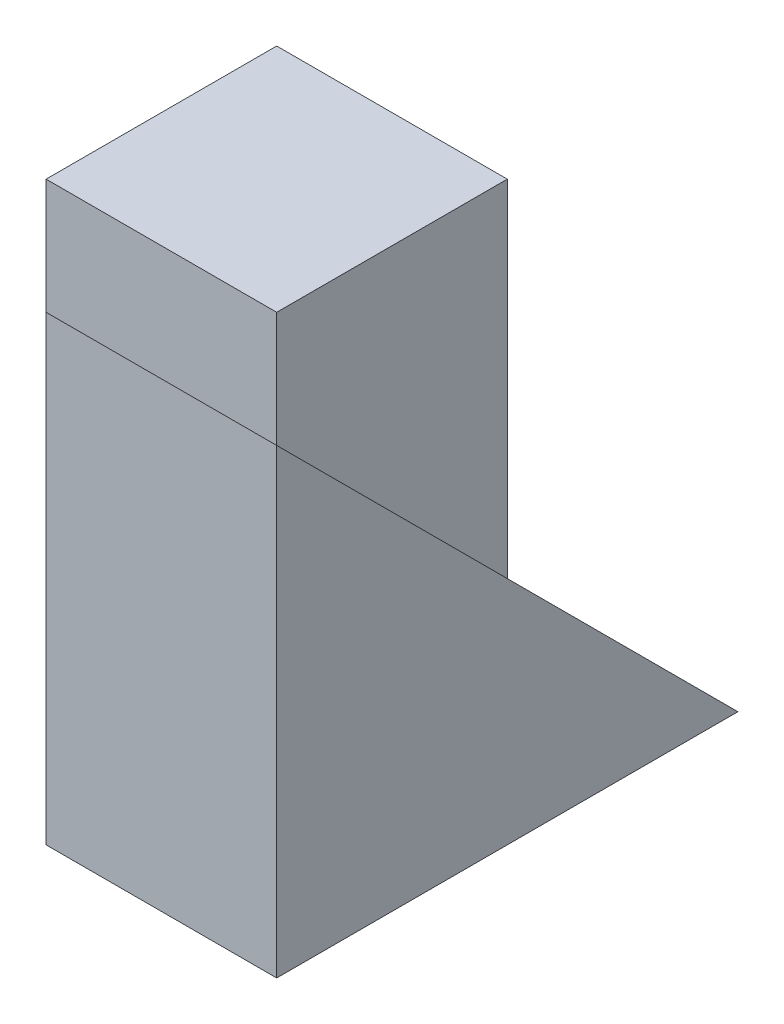
ISO-10303-21;
HEADER;
FILE_DESCRIPTION(('STEP AP214'),'2;1');
FILE_NAME('part.step','',(''),(''),'','','');
FILE_SCHEMA(('AUTOMOTIVE_DESIGN { 1 0 10303 214 1 1 1 1 }'));
ENDSEC;
DATA;
#1=APPLICATION_CONTEXT('core data for automotive mechanical design processes');
#2=APPLICATION_PROTOCOL_DEFINITION('international standard','automotive_design',2000,#1);
#3=PRODUCT_CONTEXT('',#1,'mechanical');
#4=PRODUCT('Part','Part','',(#3));
#5=PRODUCT_RELATED_PRODUCT_CATEGORY('part','',(#4));
#6=PRODUCT_DEFINITION_FORMATION('','',#4);
#7=PRODUCT_DEFINITION_CONTEXT('part definition',#1,'design');
#8=PRODUCT_DEFINITION('design','',#6,#7);
#9=PRODUCT_DEFINITION_SHAPE('','',#8);
#10=(LENGTH_UNIT() NAMED_UNIT(*) SI_UNIT(.MILLI.,.METRE.));
#11=(NAMED_UNIT(*) PLANE_ANGLE_UNIT() SI_UNIT($,.RADIAN.));
#12=(NAMED_UNIT(*) SI_UNIT($,.STERADIAN.) SOLID_ANGLE_UNIT());
#13=UNCERTAINTY_MEASURE_WITH_UNIT(LENGTH_MEASURE(1.E-05),#10,'distance_accuracy_value','');
#14=(GEOMETRIC_REPRESENTATION_CONTEXT(3) GLOBAL_UNCERTAINTY_ASSIGNED_CONTEXT((#13)) GLOBAL_UNIT_ASSIGNED_CONTEXT((#10,
#11,#12)) REPRESENTATION_CONTEXT('',''));
#15=CARTESIAN_POINT('',(0.,0.,0.));
#16=DIRECTION('',(0.,0.,1.));
#17=DIRECTION('',(1.,0.,0.));
#18=AXIS2_PLACEMENT_3D('',#15,#16,#17);
#19=CARTESIAN_POINT('',(2.,0.,0.));
#20=DIRECTION('',(0.,0.,-1.));
#21=DIRECTION('',(-1.,0.,0.));
#22=AXIS2_PLACEMENT_3D('',#19,#20,#21);
#23=PLANE('',#22);
#24=DIRECTION('',(0.,-1.,0.));
#25=VECTOR('',#24,1.);
#26=CARTESIAN_POINT('',(0.,0.,0.));
#27=LINE('',#26,#25);
#28=CARTESIAN_POINT('',(0.,4.,0.));
#29=VERTEX_POINT('',#28);
#30=CARTESIAN_POINT('',(0.,0.,0.));
#31=VERTEX_POINT('',#30);
#32=EDGE_CURVE('E106',#29,#31,#27,.T.);
#33=ORIENTED_EDGE('',*,*,#32,.T.);
#34=DIRECTION('',(-1.,0.,0.));
#35=VECTOR('',#34,1.);
#36=CARTESIAN_POINT('',(2.,0.,0.));
#37=LINE('',#36,#35);
#38=CARTESIAN_POINT('',(2.,0.,0.));
#39=VERTEX_POINT('',#38);
#40=EDGE_CURVE('E11',#39,#31,#37,.T.);
#41=ORIENTED_EDGE('',*,*,#40,.F.);
#42=DIRECTION('',(0.,-1.,0.));
#43=VECTOR('',#42,1.);
#44=CARTESIAN_POINT('',(2.,0.,0.));
#45=LINE('',#44,#43);
#46=CARTESIAN_POINT('',(2.,4.,0.));
#47=VERTEX_POINT('',#46);
#48=EDGE_CURVE('E108',#47,#39,#45,.T.);
#49=ORIENTED_EDGE('',*,*,#48,.F.);
#50=DIRECTION('',(-1.,0.,0.));
#51=VECTOR('',#50,1.);
#52=CARTESIAN_POINT('',(2.,4.,0.));
#53=LINE('',#52,#51);
#54=EDGE_CURVE('E96',#47,#29,#53,.T.);
#55=ORIENTED_EDGE('',*,*,#54,.T.);
#56=EDGE_LOOP('',(#33,#41,#49,#55));
#57=FACE_BOUND('',#56,.T.);
#58=ADVANCED_FACE('F33',(#57),#23,.F.);
#59=CARTESIAN_POINT('',(2.,0.,0.));
#60=DIRECTION('',(0.,1.,0.));
#61=DIRECTION('',(0.,0.,1.));
#62=AXIS2_PLACEMENT_3D('',#59,#60,#61);
#63=PLANE('',#62);
#64=DIRECTION('',(0.,0.,-1.));
#65=VECTOR('',#64,1.);
#66=CARTESIAN_POINT('',(0.,0.,0.));
#67=LINE('',#66,#65);
#68=CARTESIAN_POINT('',(0.,0.,-2.));
#69=VERTEX_POINT('',#68);
#70=EDGE_CURVE('E113',#31,#69,#67,.T.);
#71=ORIENTED_EDGE('',*,*,#70,.T.);
#72=DIRECTION('',(1.,0.,0.));
#73=VECTOR('',#72,1.);
#74=CARTESIAN_POINT('',(-2.,0.,-2.));
#75=LINE('',#74,#73);
#76=CARTESIAN_POINT('',(-2.,0.,-2.));
#77=VERTEX_POINT('',#76);
#78=EDGE_CURVE('E114',#77,#69,#75,.T.);
#79=ORIENTED_EDGE('',*,*,#78,.F.);
#80=DIRECTION('',(0.,0.,1.));
#81=VECTOR('',#80,1.);
#82=CARTESIAN_POINT('',(-2.,0.,-4.));
#83=LINE('',#82,#81);
#84=CARTESIAN_POINT('',(-2.,0.,-4.));
#85=VERTEX_POINT('',#84);
#86=EDGE_CURVE('E157',#85,#77,#83,.T.);
#87=ORIENTED_EDGE('',*,*,#86,.F.);
#88=DIRECTION('',(-1.,0.,0.));
#89=VECTOR('',#88,1.);
#90=CARTESIAN_POINT('',(2.,0.,-4.));
#91=LINE('',#90,#89);
#92=CARTESIAN_POINT('',(0.,0.,-4.));
#93=VERTEX_POINT('',#92);
#94=EDGE_CURVE('E109',#93,#85,#91,.T.);
#95=ORIENTED_EDGE('',*,*,#94,.F.);
#96=CARTESIAN_POINT('',(2.,0.,-4.));
#97=VERTEX_POINT('',#96);
#98=EDGE_CURVE('E41',#97,#93,#91,.T.);
#99=ORIENTED_EDGE('',*,*,#98,.F.);
#100=DIRECTION('',(0.,0.,-1.));
#101=VECTOR('',#100,1.);
#102=CARTESIAN_POINT('',(2.,0.,0.));
#103=LINE('',#102,#101);
#104=EDGE_CURVE('E110',#39,#97,#103,.T.);
#105=ORIENTED_EDGE('',*,*,#104,.F.);
#106=ORIENTED_EDGE('',*,*,#40,.T.);
#107=EDGE_LOOP('',(#71,#79,#87,#95,#99,#105,#106));
#108=FACE_BOUND('',#107,.T.);
#109=ADVANCED_FACE('F149',(#108),#63,.F.);
#110=CARTESIAN_POINT('',(2.,0.,-4.));
#111=DIRECTION('',(0.,0.,1.));
#112=DIRECTION('',(1.,0.,0.));
#113=AXIS2_PLACEMENT_3D('',#110,#111,#112);
#114=PLANE('',#113);
#115=DIRECTION('',(1.,0.,0.));
#116=VECTOR('',#115,1.);
#117=CARTESIAN_POINT('',(-2.,3.,-4.));
#118=LINE('',#117,#116);
#119=CARTESIAN_POINT('',(-2.,3.,-4.));
#120=VERTEX_POINT('',#119);
#121=CARTESIAN_POINT('',(0.,3.,-4.));
#122=VERTEX_POINT('',#121);
#123=EDGE_CURVE('E135',#120,#122,#118,.T.);
#124=ORIENTED_EDGE('',*,*,#123,.T.);
#125=DIRECTION('',(0.,1.,0.));
#126=VECTOR('',#125,1.);
#127=CARTESIAN_POINT('',(0.,0.,-4.));
#128=LINE('',#127,#126);
#129=EDGE_CURVE('E57',#93,#122,#128,.T.);
#130=ORIENTED_EDGE('',*,*,#129,.F.);
#131=ORIENTED_EDGE('',*,*,#94,.T.);
#132=DIRECTION('',(0.,-1.,0.));
#133=VECTOR('',#132,1.);
#134=CARTESIAN_POINT('',(-2.,0.,-4.));
#135=LINE('',#134,#133);
#136=EDGE_CURVE('E134',#120,#85,#135,.T.);
#137=ORIENTED_EDGE('',*,*,#136,.F.);
#138=EDGE_LOOP('',(#124,#130,#131,#137));
#139=FACE_BOUND('',#138,.T.);
#140=ADVANCED_FACE('F154',(#139),#114,.F.);
#141=CARTESIAN_POINT('',(2.,0.,0.));
#142=DIRECTION('',(-1.,0.,0.));
#143=DIRECTION('',(0.,0.,1.));
#144=AXIS2_PLACEMENT_3D('',#141,#142,#143);
#145=PLANE('',#144);
#146=ORIENTED_EDGE('',*,*,#104,.T.);
#147=DIRECTION('',(0.,-0.707106781186548,-0.707106781186548));
#148=VECTOR('',#147,1.);
#149=CARTESIAN_POINT('',(2.,4.,0.));
#150=LINE('',#149,#148);
#151=EDGE_CURVE('E146',#47,#97,#150,.T.);
#152=ORIENTED_EDGE('',*,*,#151,.F.);
#153=ORIENTED_EDGE('',*,*,#48,.T.);
#154=EDGE_LOOP('',(#146,#152,#153));
#155=FACE_BOUND('',#154,.T.);
#156=ADVANCED_FACE('F145',(#155),#145,.F.);
#157=CARTESIAN_POINT('',(0.,0.,0.));
#158=DIRECTION('',(-1.,0.,0.));
#159=DIRECTION('',(0.,0.,1.));
#160=AXIS2_PLACEMENT_3D('',#157,#158,#159);
#161=PLANE('',#160);
#162=DIRECTION('',(0.,-0.707106781186548,-0.707106781186548));
#163=VECTOR('',#162,1.);
#164=CARTESIAN_POINT('',(0.,4.,0.));
#165=LINE('',#164,#163);
#166=CARTESIAN_POINT('',(0.,2.,-2.));
#167=VERTEX_POINT('',#166);
#168=EDGE_CURVE('E93',#29,#167,#165,.T.);
#169=ORIENTED_EDGE('',*,*,#168,.T.);
#170=DIRECTION('',(0.,1.,0.));
#171=VECTOR('',#170,1.);
#172=CARTESIAN_POINT('',(0.,0.,-2.));
#173=LINE('',#172,#171);
#174=EDGE_CURVE('E49',#69,#167,#173,.T.);
#175=ORIENTED_EDGE('',*,*,#174,.F.);
#176=ORIENTED_EDGE('',*,*,#70,.F.);
#177=ORIENTED_EDGE('',*,*,#32,.F.);
#178=EDGE_LOOP('',(#169,#175,#176,#177));
#179=FACE_BOUND('',#178,.T.);
#180=ADVANCED_FACE('F112',(#179),#161,.T.);
#181=CARTESIAN_POINT('',(-2.,0.,-2.));
#182=DIRECTION('',(0.,0.,-1.));
#183=DIRECTION('',(-1.,0.,0.));
#184=AXIS2_PLACEMENT_3D('',#181,#182,#183);
#185=PLANE('',#184);
#186=ORIENTED_EDGE('',*,*,#174,.T.);
#187=DIRECTION('',(0.,1.,0.));
#188=VECTOR('',#187,1.);
#189=CARTESIAN_POINT('',(0.,0.,-2.));
#190=LINE('',#189,#188);
#191=CARTESIAN_POINT('',(0.,3.,-2.));
#192=VERTEX_POINT('',#191);
#193=EDGE_CURVE('E128',#167,#192,#190,.T.);
#194=ORIENTED_EDGE('',*,*,#193,.T.);
#195=DIRECTION('',(1.,0.,0.));
#196=VECTOR('',#195,1.);
#197=CARTESIAN_POINT('',(-2.,3.,-2.));
#198=LINE('',#197,#196);
#199=CARTESIAN_POINT('',(-2.,3.,-2.));
#200=VERTEX_POINT('',#199);
#201=EDGE_CURVE('E118',#200,#192,#198,.T.);
#202=ORIENTED_EDGE('',*,*,#201,.F.);
#203=DIRECTION('',(0.,1.,0.));
#204=VECTOR('',#203,1.);
#205=CARTESIAN_POINT('',(-2.,0.,-2.));
#206=LINE('',#205,#204);
#207=EDGE_CURVE('E160',#77,#200,#206,.T.);
#208=ORIENTED_EDGE('',*,*,#207,.F.);
#209=ORIENTED_EDGE('',*,*,#78,.T.);
#210=EDGE_LOOP('',(#186,#194,#202,#208,#209));
#211=FACE_BOUND('',#210,.T.);
#212=ADVANCED_FACE('F174',(#211),#185,.F.);
#213=CARTESIAN_POINT('',(-2.,3.,-4.));
#214=DIRECTION('',(0.,-1.,0.));
#215=DIRECTION('',(0.,0.,-1.));
#216=AXIS2_PLACEMENT_3D('',#213,#214,#215);
#217=PLANE('',#216);
#218=DIRECTION('',(0.,0.,-1.));
#219=VECTOR('',#218,1.);
#220=CARTESIAN_POINT('',(0.,3.,-4.));
#221=LINE('',#220,#219);
#222=EDGE_CURVE('E127',#192,#122,#221,.T.);
#223=ORIENTED_EDGE('',*,*,#222,.T.);
#224=ORIENTED_EDGE('',*,*,#123,.F.);
#225=DIRECTION('',(0.,0.,-1.));
#226=VECTOR('',#225,1.);
#227=CARTESIAN_POINT('',(-2.,3.,-4.));
#228=LINE('',#227,#226);
#229=EDGE_CURVE('E139',#200,#120,#228,.T.);
#230=ORIENTED_EDGE('',*,*,#229,.F.);
#231=ORIENTED_EDGE('',*,*,#201,.T.);
#232=EDGE_LOOP('',(#223,#224,#230,#231));
#233=FACE_BOUND('',#232,.T.);
#234=ADVANCED_FACE('F170',(#233),#217,.F.);
#235=CARTESIAN_POINT('',(-2.,0.,0.));
#236=DIRECTION('',(1.,0.,0.));
#237=DIRECTION('',(0.,0.,-1.));
#238=AXIS2_PLACEMENT_3D('',#235,#236,#237);
#239=PLANE('',#238);
#240=ORIENTED_EDGE('',*,*,#136,.T.);
#241=ORIENTED_EDGE('',*,*,#86,.T.);
#242=ORIENTED_EDGE('',*,*,#207,.T.);
#243=ORIENTED_EDGE('',*,*,#229,.T.);
#244=EDGE_LOOP('',(#240,#241,#242,#243));
#245=FACE_BOUND('',#244,.T.);
#246=ADVANCED_FACE('F162',(#245),#239,.F.);
#247=CARTESIAN_POINT('',(0.,0.,0.));
#248=DIRECTION('',(-1.,0.,0.));
#249=DIRECTION('',(0.,0.,1.));
#250=AXIS2_PLACEMENT_3D('',#247,#248,#249);
#251=PLANE('',#250);
#252=EDGE_CURVE('E99',#167,#93,#165,.T.);
#253=ORIENTED_EDGE('',*,*,#252,.T.);
#254=ORIENTED_EDGE('',*,*,#129,.T.);
#255=ORIENTED_EDGE('',*,*,#222,.F.);
#256=ORIENTED_EDGE('',*,*,#193,.F.);
#257=EDGE_LOOP('',(#253,#254,#255,#256));
#258=FACE_BOUND('',#257,.T.);
#259=ADVANCED_FACE('F172',(#258),#251,.F.);
#260=CARTESIAN_POINT('',(0.,4.,0.));
#261=DIRECTION('',(0.,-0.707106781186547,0.707106781186547));
#262=DIRECTION('',(0.,-0.707106781186548,-0.707106781186548));
#263=AXIS2_PLACEMENT_3D('',#260,#261,#262);
#264=PLANE('',#263);
#265=ORIENTED_EDGE('',*,*,#151,.T.);
#266=ORIENTED_EDGE('',*,*,#98,.T.);
#267=ORIENTED_EDGE('',*,*,#252,.F.);
#268=ORIENTED_EDGE('',*,*,#168,.F.);
#269=ORIENTED_EDGE('',*,*,#54,.F.);
#270=EDGE_LOOP('',(#265,#266,#267,#268,#269));
#271=FACE_BOUND('',#270,.T.);
#272=ADVANCED_FACE('F95',(#271),#264,.F.);
#273=CLOSED_SHELL('',(#58,#109,#140,#156,#180,#212,#234,#246,#259,#272));
#274=MANIFOLD_SOLID_BREP('B2',#273);
#275=ADVANCED_BREP_SHAPE_REPRESENTATION('',(#18,#274),#14);
#276=SHAPE_DEFINITION_REPRESENTATION(#9,#275);
ENDSEC;
END-ISO-10303-21;
